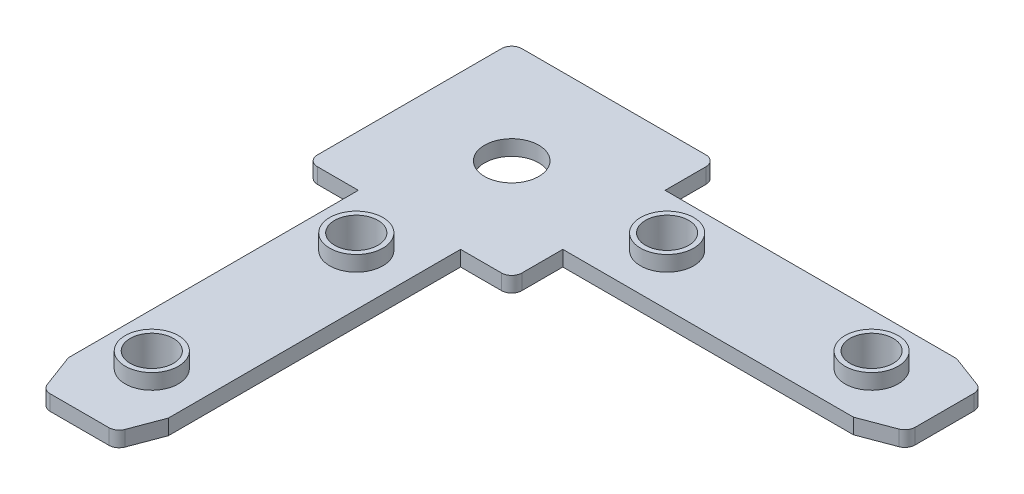
ISO-10303-21;
HEADER;
FILE_DESCRIPTION(('STEP AP214'),'2;1');
FILE_NAME('part.step','',(''),(''),'','','');
FILE_SCHEMA(('AUTOMOTIVE_DESIGN { 1 0 10303 214 1 1 1 1 }'));
ENDSEC;
DATA;
#1=APPLICATION_CONTEXT('core data for automotive mechanical design processes');
#2=APPLICATION_PROTOCOL_DEFINITION('international standard','automotive_design',2000,#1);
#3=PRODUCT_CONTEXT('',#1,'mechanical');
#4=PRODUCT('Part','Part','',(#3));
#5=PRODUCT_RELATED_PRODUCT_CATEGORY('part','',(#4));
#6=PRODUCT_DEFINITION_FORMATION('','',#4);
#7=PRODUCT_DEFINITION_CONTEXT('part definition',#1,'design');
#8=PRODUCT_DEFINITION('design','',#6,#7);
#9=PRODUCT_DEFINITION_SHAPE('','',#8);
#10=(LENGTH_UNIT() NAMED_UNIT(*) SI_UNIT(.MILLI.,.METRE.));
#11=(NAMED_UNIT(*) PLANE_ANGLE_UNIT() SI_UNIT($,.RADIAN.));
#12=(NAMED_UNIT(*) SI_UNIT($,.STERADIAN.) SOLID_ANGLE_UNIT());
#13=UNCERTAINTY_MEASURE_WITH_UNIT(LENGTH_MEASURE(1.E-05),#10,'distance_accuracy_value','');
#14=(GEOMETRIC_REPRESENTATION_CONTEXT(3) GLOBAL_UNCERTAINTY_ASSIGNED_CONTEXT((#13)) GLOBAL_UNIT_ASSIGNED_CONTEXT((#10,
#11,#12)) REPRESENTATION_CONTEXT('',''));
#15=CARTESIAN_POINT('',(0.,0.,0.));
#16=DIRECTION('',(0.,0.,1.));
#17=DIRECTION('',(1.,0.,0.));
#18=AXIS2_PLACEMENT_3D('',#15,#16,#17);
#19=CARTESIAN_POINT('',(0.,0.,0.));
#20=DIRECTION('',(-1.,0.,0.));
#21=DIRECTION('',(0.,0.,1.));
#22=AXIS2_PLACEMENT_3D('',#19,#20,#21);
#23=PLANE('',#22);
#24=DIRECTION('',(0.,0.,1.));
#25=VECTOR('',#24,1.);
#26=CARTESIAN_POINT('',(0.,0.05,5.));
#27=LINE('',#26,#25);
#28=CARTESIAN_POINT('',(0.,0.05,1.));
#29=VERTEX_POINT('',#28);
#30=CARTESIAN_POINT('',(0.,0.05,19.));
#31=VERTEX_POINT('',#30);
#32=EDGE_CURVE('E341',#29,#31,#27,.T.);
#33=ORIENTED_EDGE('',*,*,#32,.T.);
#34=DIRECTION('',(0.,-1.,0.));
#35=VECTOR('',#34,1.);
#36=CARTESIAN_POINT('',(0.,0.,19.));
#37=LINE('',#36,#35);
#38=CARTESIAN_POINT('',(0.,1.55,19.));
#39=VERTEX_POINT('',#38);
#40=EDGE_CURVE('E11',#39,#31,#37,.T.);
#41=ORIENTED_EDGE('',*,*,#40,.F.);
#42=DIRECTION('',(0.,0.,1.));
#43=VECTOR('',#42,1.);
#44=CARTESIAN_POINT('',(0.,1.55,20.));
#45=LINE('',#44,#43);
#46=CARTESIAN_POINT('',(0.,1.55,1.));
#47=VERTEX_POINT('',#46);
#48=EDGE_CURVE('E381',#47,#39,#45,.T.);
#49=ORIENTED_EDGE('',*,*,#48,.F.);
#50=DIRECTION('',(0.,1.,0.));
#51=VECTOR('',#50,1.);
#52=CARTESIAN_POINT('',(0.,0.,1.));
#53=LINE('',#52,#51);
#54=EDGE_CURVE('E540',#29,#47,#53,.T.);
#55=ORIENTED_EDGE('',*,*,#54,.F.);
#56=EDGE_LOOP('',(#33,#41,#49,#55));
#57=FACE_BOUND('',#56,.T.);
#58=ADVANCED_FACE('F16',(#57),#23,.T.);
#59=CARTESIAN_POINT('',(1.,0.,19.));
#60=DIRECTION('',(0.,1.,0.));
#61=DIRECTION('',(-0.707106781186547,0.,0.707106781186548));
#62=AXIS2_PLACEMENT_3D('',#59,#60,#61);
#63=CYLINDRICAL_SURFACE('',#62,1.);
#64=CARTESIAN_POINT('',(1.,0.05,19.));
#65=DIRECTION('',(0.,1.,0.));
#66=DIRECTION('',(-0.707106781186547,0.,0.707106781186548));
#67=AXIS2_PLACEMENT_3D('',#64,#65,#66);
#68=CIRCLE('',#67,1.);
#69=CARTESIAN_POINT('',(1.,0.05,20.));
#70=VERTEX_POINT('',#69);
#71=EDGE_CURVE('E337',#31,#70,#68,.T.);
#72=ORIENTED_EDGE('',*,*,#71,.T.);
#73=DIRECTION('',(0.,1.,0.));
#74=VECTOR('',#73,1.);
#75=CARTESIAN_POINT('',(1.,0.,20.));
#76=LINE('',#75,#74);
#77=CARTESIAN_POINT('',(1.,1.55,20.));
#78=VERTEX_POINT('',#77);
#79=EDGE_CURVE('E517',#70,#78,#76,.T.);
#80=ORIENTED_EDGE('',*,*,#79,.T.);
#81=CARTESIAN_POINT('',(1.,1.55,19.));
#82=DIRECTION('',(0.,-1.,0.));
#83=DIRECTION('',(-0.707106781186547,0.,0.707106781186548));
#84=AXIS2_PLACEMENT_3D('',#81,#82,#83);
#85=CIRCLE('',#84,1.);
#86=EDGE_CURVE('E27',#78,#39,#85,.T.);
#87=ORIENTED_EDGE('',*,*,#86,.T.);
#88=ORIENTED_EDGE('',*,*,#40,.T.);
#89=EDGE_LOOP('',(#72,#80,#87,#88));
#90=FACE_BOUND('',#89,.T.);
#91=ADVANCED_FACE('F752',(#90),#63,.T.);
#92=CARTESIAN_POINT('',(19.,0.,1.));
#93=DIRECTION('',(0.,1.,0.));
#94=DIRECTION('',(0.707106781186548,0.,-0.707106781186547));
#95=AXIS2_PLACEMENT_3D('',#92,#93,#94);
#96=CYLINDRICAL_SURFACE('',#95,1.);
#97=CARTESIAN_POINT('',(19.,0.05,1.));
#98=DIRECTION('',(0.,1.,0.));
#99=DIRECTION('',(0.707106781186548,0.,-0.707106781186547));
#100=AXIS2_PLACEMENT_3D('',#97,#98,#99);
#101=CIRCLE('',#100,1.);
#102=CARTESIAN_POINT('',(20.,0.05,1.));
#103=VERTEX_POINT('',#102);
#104=CARTESIAN_POINT('',(19.,0.05,0.));
#105=VERTEX_POINT('',#104);
#106=EDGE_CURVE('E436',#103,#105,#101,.T.);
#107=ORIENTED_EDGE('',*,*,#106,.T.);
#108=DIRECTION('',(0.,1.,0.));
#109=VECTOR('',#108,1.);
#110=CARTESIAN_POINT('',(19.,0.,0.));
#111=LINE('',#110,#109);
#112=CARTESIAN_POINT('',(19.,1.55,0.));
#113=VERTEX_POINT('',#112);
#114=EDGE_CURVE('E367',#105,#113,#111,.T.);
#115=ORIENTED_EDGE('',*,*,#114,.T.);
#116=CARTESIAN_POINT('',(19.,1.55,1.));
#117=DIRECTION('',(0.,-1.,0.));
#118=DIRECTION('',(0.707106781186548,0.,-0.707106781186547));
#119=AXIS2_PLACEMENT_3D('',#116,#117,#118);
#120=CIRCLE('',#119,1.);
#121=CARTESIAN_POINT('',(20.,1.55,1.));
#122=VERTEX_POINT('',#121);
#123=EDGE_CURVE('E371',#113,#122,#120,.T.);
#124=ORIENTED_EDGE('',*,*,#123,.T.);
#125=DIRECTION('',(0.,-1.,0.));
#126=VECTOR('',#125,1.);
#127=CARTESIAN_POINT('',(20.,0.,1.));
#128=LINE('',#127,#126);
#129=EDGE_CURVE('E449',#122,#103,#128,.T.);
#130=ORIENTED_EDGE('',*,*,#129,.T.);
#131=EDGE_LOOP('',(#107,#115,#124,#130));
#132=FACE_BOUND('',#131,.T.);
#133=ADVANCED_FACE('F747',(#132),#96,.T.);
#134=CARTESIAN_POINT('',(10.,1.55,10.));
#135=DIRECTION('',(0.,1.,0.));
#136=DIRECTION('',(1.,0.,0.));
#137=AXIS2_PLACEMENT_3D('',#134,#135,#136);
#138=PLANE('',#137);
#139=CARTESIAN_POINT('',(10.,1.55,10.));
#140=DIRECTION('',(0.,-1.,0.));
#141=DIRECTION('',(1.,0.,0.));
#142=AXIS2_PLACEMENT_3D('',#139,#140,#141);
#143=CIRCLE('',#142,2.65);
#144=CARTESIAN_POINT('',(7.35,1.55,10.));
#145=VERTEX_POINT('',#144);
#146=EDGE_CURVE('E537',#145,#145,#143,.T.);
#147=ORIENTED_EDGE('',*,*,#146,.T.);
#148=EDGE_LOOP('',(#147));
#149=FACE_BOUND('',#148,.T.);
#150=CARTESIAN_POINT('',(10.,1.55,25.2));
#151=DIRECTION('',(0.,-1.,0.));
#152=DIRECTION('',(-1.,0.,0.));
#153=AXIS2_PLACEMENT_3D('',#150,#151,#152);
#154=CIRCLE('',#153,2.6);
#155=CARTESIAN_POINT('',(12.6,1.55,25.2));
#156=VERTEX_POINT('',#155);
#157=EDGE_CURVE('E254',#156,#156,#154,.T.);
#158=ORIENTED_EDGE('',*,*,#157,.T.);
#159=EDGE_LOOP('',(#158));
#160=FACE_BOUND('',#159,.T.);
#161=CARTESIAN_POINT('',(25.2,1.55,10.));
#162=DIRECTION('',(0.,-1.,0.));
#163=DIRECTION('',(-1.,0.,0.));
#164=AXIS2_PLACEMENT_3D('',#161,#162,#163);
#165=CIRCLE('',#164,2.6);
#166=CARTESIAN_POINT('',(27.8,1.55,10.));
#167=VERTEX_POINT('',#166);
#168=EDGE_CURVE('E20',#167,#167,#165,.T.);
#169=ORIENTED_EDGE('',*,*,#168,.T.);
#170=EDGE_LOOP('',(#169));
#171=FACE_BOUND('',#170,.T.);
#172=CARTESIAN_POINT('',(10.,1.55,45.2));
#173=DIRECTION('',(0.,-1.,0.));
#174=DIRECTION('',(-1.,0.,0.));
#175=AXIS2_PLACEMENT_3D('',#172,#173,#174);
#176=CIRCLE('',#175,2.6);
#177=CARTESIAN_POINT('',(12.6,1.55,45.2));
#178=VERTEX_POINT('',#177);
#179=EDGE_CURVE('E365',#178,#178,#176,.T.);
#180=ORIENTED_EDGE('',*,*,#179,.T.);
#181=EDGE_LOOP('',(#180));
#182=FACE_BOUND('',#181,.T.);
#183=CARTESIAN_POINT('',(45.2,1.55,10.));
#184=DIRECTION('',(0.,-1.,0.));
#185=DIRECTION('',(-1.,0.,0.));
#186=AXIS2_PLACEMENT_3D('',#183,#184,#185);
#187=CIRCLE('',#186,2.6);
#188=CARTESIAN_POINT('',(47.8,1.55,10.));
#189=VERTEX_POINT('',#188);
#190=EDGE_CURVE('E366',#189,#189,#187,.T.);
#191=ORIENTED_EDGE('',*,*,#190,.T.);
#192=EDGE_LOOP('',(#191));
#193=FACE_BOUND('',#192,.T.);
#194=CARTESIAN_POINT('',(51.3,1.55,7.10603201825691));
#195=DIRECTION('',(0.,-1.,0.));
#196=DIRECTION('',(0.821616308212907,0.,-0.570040912635746));
#197=AXIS2_PLACEMENT_3D('',#194,#195,#196);
#198=CIRCLE('',#197,1.);
#199=CARTESIAN_POINT('',(51.6501067158428,1.55,6.16932219791671));
#200=VERTEX_POINT('',#199);
#201=CARTESIAN_POINT('',(52.3,1.55,7.10603201825691));
#202=VERTEX_POINT('',#201);
#203=EDGE_CURVE('E330',#200,#202,#198,.T.);
#204=ORIENTED_EDGE('',*,*,#203,.F.);
#205=DIRECTION('',(-0.936709820340194,0.,-0.350106715842815));
#206=VECTOR('',#205,1.);
#207=CARTESIAN_POINT('',(48.5215875062253,1.55,5.));
#208=LINE('',#207,#206);
#209=CARTESIAN_POINT('',(48.5215875062253,1.55,5.));
#210=VERTEX_POINT('',#209);
#211=EDGE_CURVE('E411',#200,#210,#208,.T.);
#212=ORIENTED_EDGE('',*,*,#211,.T.);
#213=DIRECTION('',(-1.,0.,0.));
#214=VECTOR('',#213,1.);
#215=CARTESIAN_POINT('',(48.5215875062253,1.55,5.));
#216=LINE('',#215,#214);
#217=CARTESIAN_POINT('',(20.,1.55,5.));
#218=VERTEX_POINT('',#217);
#219=EDGE_CURVE('E412',#210,#218,#216,.T.);
#220=ORIENTED_EDGE('',*,*,#219,.T.);
#221=DIRECTION('',(0.,0.,-1.));
#222=VECTOR('',#221,1.);
#223=CARTESIAN_POINT('',(20.,1.55,0.));
#224=LINE('',#223,#222);
#225=EDGE_CURVE('E243',#218,#122,#224,.T.);
#226=ORIENTED_EDGE('',*,*,#225,.T.);
#227=ORIENTED_EDGE('',*,*,#123,.F.);
#228=DIRECTION('',(-1.,0.,0.));
#229=VECTOR('',#228,1.);
#230=CARTESIAN_POINT('',(0.,1.55,0.));
#231=LINE('',#230,#229);
#232=CARTESIAN_POINT('',(1.,1.55,0.));
#233=VERTEX_POINT('',#232);
#234=EDGE_CURVE('E372',#113,#233,#231,.T.);
#235=ORIENTED_EDGE('',*,*,#234,.T.);
#236=CARTESIAN_POINT('',(1.,1.55,1.));
#237=DIRECTION('',(0.,-1.,0.));
#238=DIRECTION('',(-0.707106781186547,0.,-0.707106781186548));
#239=AXIS2_PLACEMENT_3D('',#236,#237,#238);
#240=CIRCLE('',#239,1.);
#241=EDGE_CURVE('E526',#47,#233,#240,.T.);
#242=ORIENTED_EDGE('',*,*,#241,.F.);
#243=ORIENTED_EDGE('',*,*,#48,.T.);
#244=ORIENTED_EDGE('',*,*,#86,.F.);
#245=DIRECTION('',(1.,0.,0.));
#246=VECTOR('',#245,1.);
#247=CARTESIAN_POINT('',(20.,1.55,20.));
#248=LINE('',#247,#246);
#249=CARTESIAN_POINT('',(5.,1.55,20.));
#250=VERTEX_POINT('',#249);
#251=EDGE_CURVE('E522',#78,#250,#248,.T.);
#252=ORIENTED_EDGE('',*,*,#251,.T.);
#253=DIRECTION('',(0.,0.,1.));
#254=VECTOR('',#253,1.);
#255=CARTESIAN_POINT('',(5.,1.55,48.362618433622));
#256=LINE('',#255,#254);
#257=CARTESIAN_POINT('',(5.,1.55,48.362618433622));
#258=VERTEX_POINT('',#257);
#259=EDGE_CURVE('E510',#250,#258,#256,.T.);
#260=ORIENTED_EDGE('',*,*,#259,.T.);
#261=DIRECTION('',(0.350106715842814,0.,0.936709820340194));
#262=VECTOR('',#261,1.);
#263=CARTESIAN_POINT('',(6.4716443655133,1.55,52.3));
#264=LINE('',#263,#262);
#265=CARTESIAN_POINT('',(6.22873882697423,1.55,51.6501067158428));
#266=VERTEX_POINT('',#265);
#267=EDGE_CURVE('E500',#258,#266,#264,.T.);
#268=ORIENTED_EDGE('',*,*,#267,.T.);
#269=CARTESIAN_POINT('',(7.16544864731442,1.55,51.3));
#270=DIRECTION('',(0.,-1.,0.));
#271=DIRECTION('',(-0.570040912635746,0.,0.821616308212907));
#272=AXIS2_PLACEMENT_3D('',#269,#270,#271);
#273=CIRCLE('',#272,1.);
#274=CARTESIAN_POINT('',(7.16544864731442,1.55,52.3));
#275=VERTEX_POINT('',#274);
#276=EDGE_CURVE('E326',#275,#266,#273,.T.);
#277=ORIENTED_EDGE('',*,*,#276,.F.);
#278=DIRECTION('',(1.,0.,0.));
#279=VECTOR('',#278,1.);
#280=CARTESIAN_POINT('',(13.599486309307,1.55,52.3));
#281=LINE('',#280,#279);
#282=CARTESIAN_POINT('',(12.9073882325654,1.55,52.3));
#283=VERTEX_POINT('',#282);
#284=EDGE_CURVE('E393',#275,#283,#281,.T.);
#285=ORIENTED_EDGE('',*,*,#284,.T.);
#286=CARTESIAN_POINT('',(12.9073882325654,1.55,51.3));
#287=DIRECTION('',(0.,-1.,0.));
#288=DIRECTION('',(0.569093456951135,0.,0.822272848424054));
#289=AXIS2_PLACEMENT_3D('',#286,#287,#288);
#290=CIRCLE('',#289,1.);
#291=CARTESIAN_POINT('',(13.8432884282988,1.55,51.6522652745108));
#292=VERTEX_POINT('',#291);
#293=EDGE_CURVE('E427',#292,#283,#290,.T.);
#294=ORIENTED_EDGE('',*,*,#293,.F.);
#295=DIRECTION('',(0.352265274510817,0.,-0.935900195733401));
#296=VECTOR('',#295,1.);
#297=CARTESIAN_POINT('',(13.599486309307,1.55,52.3));
#298=LINE('',#297,#296);
#299=CARTESIAN_POINT('',(15.,1.55,48.5791080129398));
#300=VERTEX_POINT('',#299);
#301=EDGE_CURVE('E426',#292,#300,#298,.T.);
#302=ORIENTED_EDGE('',*,*,#301,.T.);
#303=DIRECTION('',(0.,0.,-1.));
#304=VECTOR('',#303,1.);
#305=CARTESIAN_POINT('',(15.,1.55,20.));
#306=LINE('',#305,#304);
#307=CARTESIAN_POINT('',(15.,1.55,20.));
#308=VERTEX_POINT('',#307);
#309=EDGE_CURVE('E347',#300,#308,#306,.T.);
#310=ORIENTED_EDGE('',*,*,#309,.T.);
#311=DIRECTION('',(1.,0.,0.));
#312=VECTOR('',#311,1.);
#313=CARTESIAN_POINT('',(20.,1.55,20.));
#314=LINE('',#313,#312);
#315=CARTESIAN_POINT('',(19.,1.55,20.));
#316=VERTEX_POINT('',#315);
#317=EDGE_CURVE('E360',#308,#316,#314,.T.);
#318=ORIENTED_EDGE('',*,*,#317,.T.);
#319=CARTESIAN_POINT('',(19.,1.55,19.));
#320=DIRECTION('',(0.,-1.,0.));
#321=DIRECTION('',(0.707106781186548,0.,0.707106781186548));
#322=AXIS2_PLACEMENT_3D('',#319,#320,#321);
#323=CIRCLE('',#322,1.);
#324=CARTESIAN_POINT('',(20.,1.55,19.));
#325=VERTEX_POINT('',#324);
#326=EDGE_CURVE('E296',#325,#316,#323,.T.);
#327=ORIENTED_EDGE('',*,*,#326,.F.);
#328=DIRECTION('',(0.,0.,-1.));
#329=VECTOR('',#328,1.);
#330=CARTESIAN_POINT('',(20.,1.55,0.));
#331=LINE('',#330,#329);
#332=CARTESIAN_POINT('',(20.,1.55,15.));
#333=VERTEX_POINT('',#332);
#334=EDGE_CURVE('E295',#325,#333,#331,.T.);
#335=ORIENTED_EDGE('',*,*,#334,.T.);
#336=DIRECTION('',(1.,0.,0.));
#337=VECTOR('',#336,1.);
#338=CARTESIAN_POINT('',(20.,1.55,15.));
#339=LINE('',#338,#337);
#340=CARTESIAN_POINT('',(48.4216847114083,1.55,15.));
#341=VERTEX_POINT('',#340);
#342=EDGE_CURVE('E291',#333,#341,#339,.T.);
#343=ORIENTED_EDGE('',*,*,#342,.T.);
#344=DIRECTION('',(0.935900195733402,0.,-0.352265274510816));
#345=VECTOR('',#344,1.);
#346=CARTESIAN_POINT('',(48.4216847114083,1.55,15.));
#347=LINE('',#346,#345);
#348=CARTESIAN_POINT('',(51.6522652745108,1.55,13.7840355690931));
#349=VERTEX_POINT('',#348);
#350=EDGE_CURVE('E465',#341,#349,#347,.T.);
#351=ORIENTED_EDGE('',*,*,#350,.T.);
#352=CARTESIAN_POINT('',(51.3,1.55,12.8481353733597));
#353=DIRECTION('',(0.,-1.,0.));
#354=DIRECTION('',(0.822272848424054,0.,0.569093456951135));
#355=AXIS2_PLACEMENT_3D('',#352,#353,#354);
#356=CIRCLE('',#355,1.);
#357=CARTESIAN_POINT('',(52.3,1.55,12.8481353733597));
#358=VERTEX_POINT('',#357);
#359=EDGE_CURVE('E432',#358,#349,#356,.T.);
#360=ORIENTED_EDGE('',*,*,#359,.F.);
#361=DIRECTION('',(0.,0.,-1.));
#362=VECTOR('',#361,1.);
#363=CARTESIAN_POINT('',(52.3,1.55,13.5402334501013));
#364=LINE('',#363,#362);
#365=EDGE_CURVE('E431',#358,#202,#364,.T.);
#366=ORIENTED_EDGE('',*,*,#365,.T.);
#367=EDGE_LOOP('',(#204,#212,#220,#226,#227,#235,#242,#243,#244,#252,#260,#268,#277,#285,#294,
#302,#310,#318,#327,#335,#343,#351,#360,#366));
#368=FACE_BOUND('',#367,.T.);
#369=ADVANCED_FACE('F665',(#149,#160,#171,#182,#193,#368),#138,.T.);
#370=CARTESIAN_POINT('',(20.,0.,0.));
#371=DIRECTION('',(0.,0.,-1.));
#372=DIRECTION('',(-1.,0.,0.));
#373=AXIS2_PLACEMENT_3D('',#370,#371,#372);
#374=PLANE('',#373);
#375=DIRECTION('',(-1.,0.,0.));
#376=VECTOR('',#375,1.);
#377=CARTESIAN_POINT('',(15.,0.05,0.));
#378=LINE('',#377,#376);
#379=CARTESIAN_POINT('',(1.,0.05,0.));
#380=VERTEX_POINT('',#379);
#381=EDGE_CURVE('E357',#105,#380,#378,.T.);
#382=ORIENTED_EDGE('',*,*,#381,.T.);
#383=DIRECTION('',(0.,-1.,0.));
#384=VECTOR('',#383,1.);
#385=CARTESIAN_POINT('',(1.,0.,0.));
#386=LINE('',#385,#384);
#387=EDGE_CURVE('E523',#233,#380,#386,.T.);
#388=ORIENTED_EDGE('',*,*,#387,.F.);
#389=ORIENTED_EDGE('',*,*,#234,.F.);
#390=ORIENTED_EDGE('',*,*,#114,.F.);
#391=EDGE_LOOP('',(#382,#388,#389,#390));
#392=FACE_BOUND('',#391,.T.);
#393=ADVANCED_FACE('F659',(#392),#374,.T.);
#394=CARTESIAN_POINT('',(1.,0.,1.));
#395=DIRECTION('',(0.,1.,0.));
#396=DIRECTION('',(-0.707106781186547,0.,-0.707106781186548));
#397=AXIS2_PLACEMENT_3D('',#394,#395,#396);
#398=CYLINDRICAL_SURFACE('',#397,1.);
#399=CARTESIAN_POINT('',(1.,0.05,1.));
#400=DIRECTION('',(0.,1.,0.));
#401=DIRECTION('',(-0.707106781186547,0.,-0.707106781186548));
#402=AXIS2_PLACEMENT_3D('',#399,#400,#401);
#403=CIRCLE('',#402,1.);
#404=EDGE_CURVE('E353',#380,#29,#403,.T.);
#405=ORIENTED_EDGE('',*,*,#404,.T.);
#406=ORIENTED_EDGE('',*,*,#54,.T.);
#407=ORIENTED_EDGE('',*,*,#241,.T.);
#408=ORIENTED_EDGE('',*,*,#387,.T.);
#409=EDGE_LOOP('',(#405,#406,#407,#408));
#410=FACE_BOUND('',#409,.T.);
#411=ADVANCED_FACE('F664',(#410),#398,.T.);
#412=CARTESIAN_POINT('',(10.,0.,10.));
#413=DIRECTION('',(0.,1.,0.));
#414=DIRECTION('',(1.,0.,0.));
#415=AXIS2_PLACEMENT_3D('',#412,#413,#414);
#416=CYLINDRICAL_SURFACE('',#415,2.65);
#417=CARTESIAN_POINT('',(10.,0.05,10.));
#418=DIRECTION('',(0.,-1.,0.));
#419=DIRECTION('',(1.,0.,0.));
#420=AXIS2_PLACEMENT_3D('',#417,#418,#419);
#421=CIRCLE('',#420,2.65);
#422=CARTESIAN_POINT('',(7.35,0.05,10.));
#423=VERTEX_POINT('',#422);
#424=EDGE_CURVE('E335',#423,#423,#421,.T.);
#425=ORIENTED_EDGE('',*,*,#424,.T.);
#426=DIRECTION('',(0.,1.,0.));
#427=VECTOR('',#426,1.);
#428=CARTESIAN_POINT('',(7.35,0.,10.));
#429=LINE('',#428,#427);
#430=EDGE_CURVE('E521',#423,#145,#429,.T.);
#431=ORIENTED_EDGE('',*,*,#430,.T.);
#432=ORIENTED_EDGE('',*,*,#146,.F.);
#433=ORIENTED_EDGE('',*,*,#430,.F.);
#434=EDGE_LOOP('',(#425,#431,#432,#433));
#435=FACE_BOUND('',#434,.T.);
#436=ADVANCED_FACE('F686',(#435),#416,.F.);
#437=CARTESIAN_POINT('',(0.,0.,20.));
#438=DIRECTION('',(0.,0.,1.));
#439=DIRECTION('',(1.,0.,0.));
#440=AXIS2_PLACEMENT_3D('',#437,#438,#439);
#441=PLANE('',#440);
#442=DIRECTION('',(1.,0.,0.));
#443=VECTOR('',#442,1.);
#444=CARTESIAN_POINT('',(5.,0.05,20.));
#445=LINE('',#444,#443);
#446=CARTESIAN_POINT('',(5.,0.05,20.));
#447=VERTEX_POINT('',#446);
#448=EDGE_CURVE('E342',#70,#447,#445,.T.);
#449=ORIENTED_EDGE('',*,*,#448,.T.);
#450=DIRECTION('',(0.,1.,0.));
#451=VECTOR('',#450,1.);
#452=CARTESIAN_POINT('',(5.,0.,20.));
#453=LINE('',#452,#451);
#454=EDGE_CURVE('E513',#447,#250,#453,.T.);
#455=ORIENTED_EDGE('',*,*,#454,.T.);
#456=ORIENTED_EDGE('',*,*,#251,.F.);
#457=ORIENTED_EDGE('',*,*,#79,.F.);
#458=EDGE_LOOP('',(#449,#455,#456,#457));
#459=FACE_BOUND('',#458,.T.);
#460=ADVANCED_FACE('F691',(#459),#441,.T.);
#461=CARTESIAN_POINT('',(5.,0.,20.));
#462=DIRECTION('',(-1.,0.,0.));
#463=DIRECTION('',(0.,0.,1.));
#464=AXIS2_PLACEMENT_3D('',#461,#462,#463);
#465=PLANE('',#464);
#466=DIRECTION('',(0.,0.,1.));
#467=VECTOR('',#466,1.);
#468=CARTESIAN_POINT('',(5.,0.05,15.));
#469=LINE('',#468,#467);
#470=CARTESIAN_POINT('',(5.,0.05,48.362618433622));
#471=VERTEX_POINT('',#470);
#472=EDGE_CURVE('E377',#447,#471,#469,.T.);
#473=ORIENTED_EDGE('',*,*,#472,.T.);
#474=DIRECTION('',(0.,1.,0.));
#475=VECTOR('',#474,1.);
#476=CARTESIAN_POINT('',(5.,0.,48.362618433622));
#477=LINE('',#476,#475);
#478=EDGE_CURVE('E509',#471,#258,#477,.T.);
#479=ORIENTED_EDGE('',*,*,#478,.T.);
#480=ORIENTED_EDGE('',*,*,#259,.F.);
#481=ORIENTED_EDGE('',*,*,#454,.F.);
#482=EDGE_LOOP('',(#473,#479,#480,#481));
#483=FACE_BOUND('',#482,.T.);
#484=ADVANCED_FACE('F794',(#483),#465,.T.);
#485=CARTESIAN_POINT('',(5.,0.,48.362618433622));
#486=DIRECTION('',(-0.936709820340194,0.,0.350106715842814));
#487=DIRECTION('',(0.,1.,0.));
#488=AXIS2_PLACEMENT_3D('',#485,#486,#487);
#489=PLANE('',#488);
#490=DIRECTION('',(0.350106715842814,0.,0.936709820340194));
#491=VECTOR('',#490,1.);
#492=CARTESIAN_POINT('',(-0.984042865206179,0.05,32.3523236762604));
#493=LINE('',#492,#491);
#494=CARTESIAN_POINT('',(6.22873882697423,0.05,51.6501067158428));
#495=VERTEX_POINT('',#494);
#496=EDGE_CURVE('E373',#471,#495,#493,.T.);
#497=ORIENTED_EDGE('',*,*,#496,.T.);
#498=DIRECTION('',(0.,-1.,0.));
#499=VECTOR('',#498,1.);
#500=CARTESIAN_POINT('',(6.22873882697423,0.,51.6501067158428));
#501=LINE('',#500,#499);
#502=EDGE_CURVE('E329',#266,#495,#501,.T.);
#503=ORIENTED_EDGE('',*,*,#502,.F.);
#504=ORIENTED_EDGE('',*,*,#267,.F.);
#505=ORIENTED_EDGE('',*,*,#478,.F.);
#506=EDGE_LOOP('',(#497,#503,#504,#505));
#507=FACE_BOUND('',#506,.T.);
#508=ADVANCED_FACE('F799',(#507),#489,.T.);
#509=CARTESIAN_POINT('',(20.,0.,20.));
#510=DIRECTION('',(1.,0.,0.));
#511=DIRECTION('',(0.,1.,0.));
#512=AXIS2_PLACEMENT_3D('',#509,#510,#511);
#513=PLANE('',#512);
#514=DIRECTION('',(0.,0.,-1.));
#515=VECTOR('',#514,1.);
#516=CARTESIAN_POINT('',(20.,0.05,15.));
#517=LINE('',#516,#515);
#518=CARTESIAN_POINT('',(20.,0.05,5.));
#519=VERTEX_POINT('',#518);
#520=EDGE_CURVE('E489',#519,#103,#517,.T.);
#521=ORIENTED_EDGE('',*,*,#520,.T.);
#522=ORIENTED_EDGE('',*,*,#129,.F.);
#523=ORIENTED_EDGE('',*,*,#225,.F.);
#524=DIRECTION('',(0.,-1.,0.));
#525=VECTOR('',#524,1.);
#526=CARTESIAN_POINT('',(20.,0.,5.));
#527=LINE('',#526,#525);
#528=EDGE_CURVE('E402',#218,#519,#527,.T.);
#529=ORIENTED_EDGE('',*,*,#528,.T.);
#530=EDGE_LOOP('',(#521,#522,#523,#529));
#531=FACE_BOUND('',#530,.T.);
#532=ADVANCED_FACE('F809',(#531),#513,.T.);
#533=CARTESIAN_POINT('',(52.3,0.,6.41222773645579));
#534=DIRECTION('',(0.350106715842815,0.,-0.936709820340194));
#535=DIRECTION('',(0.,-1.,0.));
#536=AXIS2_PLACEMENT_3D('',#533,#534,#535);
#537=PLANE('',#536);
#538=DIRECTION('',(-0.936709820340194,0.,-0.350106715842815));
#539=VECTOR('',#538,1.);
#540=CARTESIAN_POINT('',(34.330757253633,0.05,-0.303995823395481));
#541=LINE('',#540,#539);
#542=CARTESIAN_POINT('',(51.6501067158428,0.05,6.16932219791671));
#543=VERTEX_POINT('',#542);
#544=CARTESIAN_POINT('',(48.5215875062253,0.05,5.));
#545=VERTEX_POINT('',#544);
#546=EDGE_CURVE('E456',#543,#545,#541,.T.);
#547=ORIENTED_EDGE('',*,*,#546,.T.);
#548=DIRECTION('',(0.,1.,0.));
#549=VECTOR('',#548,1.);
#550=CARTESIAN_POINT('',(48.5215875062253,0.,5.));
#551=LINE('',#550,#549);
#552=EDGE_CURVE('E407',#545,#210,#551,.T.);
#553=ORIENTED_EDGE('',*,*,#552,.T.);
#554=ORIENTED_EDGE('',*,*,#211,.F.);
#555=DIRECTION('',(0.,1.,0.));
#556=VECTOR('',#555,1.);
#557=CARTESIAN_POINT('',(51.6501067158428,0.,6.16932219791671));
#558=LINE('',#557,#556);
#559=EDGE_CURVE('E516',#543,#200,#558,.T.);
#560=ORIENTED_EDGE('',*,*,#559,.F.);
#561=EDGE_LOOP('',(#547,#553,#554,#560));
#562=FACE_BOUND('',#561,.T.);
#563=ADVANCED_FACE('F909',(#562),#537,.T.);
#564=CARTESIAN_POINT('',(48.5215875062253,0.,5.));
#565=DIRECTION('',(0.,0.,-1.));
#566=DIRECTION('',(0.,-1.,0.));
#567=AXIS2_PLACEMENT_3D('',#564,#565,#566);
#568=PLANE('',#567);
#569=DIRECTION('',(-1.,0.,0.));
#570=VECTOR('',#569,1.);
#571=CARTESIAN_POINT('',(29.2607937531126,0.05,5.));
#572=LINE('',#571,#570);
#573=EDGE_CURVE('E461',#545,#519,#572,.T.);
#574=ORIENTED_EDGE('',*,*,#573,.T.);
#575=ORIENTED_EDGE('',*,*,#528,.F.);
#576=ORIENTED_EDGE('',*,*,#219,.F.);
#577=ORIENTED_EDGE('',*,*,#552,.F.);
#578=EDGE_LOOP('',(#574,#575,#576,#577));
#579=FACE_BOUND('',#578,.T.);
#580=ADVANCED_FACE('F904',(#579),#568,.T.);
#581=CARTESIAN_POINT('',(45.2,0.,10.));
#582=DIRECTION('',(0.,1.,0.));
#583=DIRECTION('',(1.,0.,0.));
#584=AXIS2_PLACEMENT_3D('',#581,#582,#583);
#585=CYLINDRICAL_SURFACE('',#584,2.117);
#586=CARTESIAN_POINT('',(45.2,0.05,10.));
#587=DIRECTION('',(0.,-1.,0.));
#588=DIRECTION('',(1.,0.,0.));
#589=AXIS2_PLACEMENT_3D('',#586,#587,#588);
#590=CIRCLE('',#589,2.117);
#591=CARTESIAN_POINT('',(43.083,0.05,10.));
#592=VERTEX_POINT('',#591);
#593=EDGE_CURVE('E331',#592,#592,#590,.T.);
#594=ORIENTED_EDGE('',*,*,#593,.T.);
#595=DIRECTION('',(0.,1.,0.));
#596=VECTOR('',#595,1.);
#597=CARTESIAN_POINT('',(43.083,0.,10.));
#598=LINE('',#597,#596);
#599=CARTESIAN_POINT('',(43.083,3.05,10.));
#600=VERTEX_POINT('',#599);
#601=EDGE_CURVE('E399',#592,#600,#598,.T.);
#602=ORIENTED_EDGE('',*,*,#601,.T.);
#603=CARTESIAN_POINT('',(45.2,3.05,10.));
#604=DIRECTION('',(0.,1.,0.));
#605=DIRECTION('',(1.,0.,0.));
#606=AXIS2_PLACEMENT_3D('',#603,#604,#605);
#607=CIRCLE('',#606,2.117);
#608=EDGE_CURVE('E324',#600,#600,#607,.T.);
#609=ORIENTED_EDGE('',*,*,#608,.T.);
#610=ORIENTED_EDGE('',*,*,#601,.F.);
#611=EDGE_LOOP('',(#594,#602,#609,#610));
#612=FACE_BOUND('',#611,.T.);
#613=ADVANCED_FACE('F875',(#612),#585,.F.);
#614=CARTESIAN_POINT('',(10.,0.,45.2));
#615=DIRECTION('',(0.,1.,0.));
#616=DIRECTION('',(1.,0.,0.));
#617=AXIS2_PLACEMENT_3D('',#614,#615,#616);
#618=CYLINDRICAL_SURFACE('',#617,2.117);
#619=CARTESIAN_POINT('',(10.,0.05,45.2));
#620=DIRECTION('',(0.,-1.,0.));
#621=DIRECTION('',(1.,0.,0.));
#622=AXIS2_PLACEMENT_3D('',#619,#620,#621);
#623=CIRCLE('',#622,2.117);
#624=CARTESIAN_POINT('',(7.883,0.05,45.2));
#625=VERTEX_POINT('',#624);
#626=EDGE_CURVE('E336',#625,#625,#623,.T.);
#627=ORIENTED_EDGE('',*,*,#626,.T.);
#628=DIRECTION('',(0.,1.,0.));
#629=VECTOR('',#628,1.);
#630=CARTESIAN_POINT('',(7.883,0.,45.2));
#631=LINE('',#630,#629);
#632=CARTESIAN_POINT('',(7.883,3.05,45.2));
#633=VERTEX_POINT('',#632);
#634=EDGE_CURVE('E403',#625,#633,#631,.T.);
#635=ORIENTED_EDGE('',*,*,#634,.T.);
#636=CARTESIAN_POINT('',(10.,3.05,45.2));
#637=DIRECTION('',(0.,1.,0.));
#638=DIRECTION('',(1.,0.,0.));
#639=AXIS2_PLACEMENT_3D('',#636,#637,#638);
#640=CIRCLE('',#639,2.117);
#641=EDGE_CURVE('E420',#633,#633,#640,.T.);
#642=ORIENTED_EDGE('',*,*,#641,.T.);
#643=ORIENTED_EDGE('',*,*,#634,.F.);
#644=EDGE_LOOP('',(#627,#635,#642,#643));
#645=FACE_BOUND('',#644,.T.);
#646=ADVANCED_FACE('F679',(#645),#618,.F.);
#647=CARTESIAN_POINT('',(25.2,0.,10.));
#648=DIRECTION('',(0.,1.,0.));
#649=DIRECTION('',(1.,0.,0.));
#650=AXIS2_PLACEMENT_3D('',#647,#648,#649);
#651=CYLINDRICAL_SURFACE('',#650,2.117);
#652=CARTESIAN_POINT('',(25.2,0.05,10.));
#653=DIRECTION('',(0.,-1.,0.));
#654=DIRECTION('',(1.,0.,0.));
#655=AXIS2_PLACEMENT_3D('',#652,#653,#654);
#656=CIRCLE('',#655,2.117);
#657=CARTESIAN_POINT('',(23.083,0.05,10.));
#658=VERTEX_POINT('',#657);
#659=EDGE_CURVE('E346',#658,#658,#656,.T.);
#660=ORIENTED_EDGE('',*,*,#659,.T.);
#661=DIRECTION('',(0.,1.,0.));
#662=VECTOR('',#661,1.);
#663=CARTESIAN_POINT('',(23.083,0.,10.));
#664=LINE('',#663,#662);
#665=CARTESIAN_POINT('',(23.083,3.05,10.));
#666=VERTEX_POINT('',#665);
#667=EDGE_CURVE('E445',#658,#666,#664,.T.);
#668=ORIENTED_EDGE('',*,*,#667,.T.);
#669=CARTESIAN_POINT('',(25.2,3.05,10.));
#670=DIRECTION('',(0.,1.,0.));
#671=DIRECTION('',(1.,0.,0.));
#672=AXIS2_PLACEMENT_3D('',#669,#670,#671);
#673=CIRCLE('',#672,2.117);
#674=EDGE_CURVE('E421',#666,#666,#673,.T.);
#675=ORIENTED_EDGE('',*,*,#674,.T.);
#676=ORIENTED_EDGE('',*,*,#667,.F.);
#677=EDGE_LOOP('',(#660,#668,#675,#676));
#678=FACE_BOUND('',#677,.T.);
#679=ADVANCED_FACE('F640',(#678),#651,.F.);
#680=CARTESIAN_POINT('',(10.,0.,25.2));
#681=DIRECTION('',(0.,1.,0.));
#682=DIRECTION('',(1.,0.,0.));
#683=AXIS2_PLACEMENT_3D('',#680,#681,#682);
#684=CYLINDRICAL_SURFACE('',#683,2.117);
#685=CARTESIAN_POINT('',(10.,0.05,25.2));
#686=DIRECTION('',(0.,-1.,0.));
#687=DIRECTION('',(1.,0.,0.));
#688=AXIS2_PLACEMENT_3D('',#685,#686,#687);
#689=CIRCLE('',#688,2.117);
#690=CARTESIAN_POINT('',(7.883,0.05,25.2));
#691=VERTEX_POINT('',#690);
#692=EDGE_CURVE('E460',#691,#691,#689,.T.);
#693=ORIENTED_EDGE('',*,*,#692,.T.);
#694=DIRECTION('',(0.,1.,0.));
#695=VECTOR('',#694,1.);
#696=CARTESIAN_POINT('',(7.883,0.,25.2));
#697=LINE('',#696,#695);
#698=CARTESIAN_POINT('',(7.883,3.05,25.2));
#699=VERTEX_POINT('',#698);
#700=EDGE_CURVE('E448',#691,#699,#697,.T.);
#701=ORIENTED_EDGE('',*,*,#700,.T.);
#702=CARTESIAN_POINT('',(10.,3.05,25.2));
#703=DIRECTION('',(0.,1.,0.));
#704=DIRECTION('',(1.,0.,0.));
#705=AXIS2_PLACEMENT_3D('',#702,#703,#704);
#706=CIRCLE('',#705,2.117);
#707=EDGE_CURVE('E439',#699,#699,#706,.T.);
#708=ORIENTED_EDGE('',*,*,#707,.T.);
#709=ORIENTED_EDGE('',*,*,#700,.F.);
#710=EDGE_LOOP('',(#693,#701,#708,#709));
#711=FACE_BOUND('',#710,.T.);
#712=ADVANCED_FACE('F678',(#711),#684,.F.);
#713=CARTESIAN_POINT('',(10.,1.55,25.2));
#714=DIRECTION('',(0.,1.,0.));
#715=DIRECTION('',(-1.,0.,0.));
#716=AXIS2_PLACEMENT_3D('',#713,#714,#715);
#717=CYLINDRICAL_SURFACE('',#716,2.6);
#718=CARTESIAN_POINT('',(10.,3.05,25.2));
#719=DIRECTION('',(0.,-1.,0.));
#720=DIRECTION('',(-1.,0.,0.));
#721=AXIS2_PLACEMENT_3D('',#718,#719,#720);
#722=CIRCLE('',#721,2.6);
#723=CARTESIAN_POINT('',(12.6,3.05,25.2));
#724=VERTEX_POINT('',#723);
#725=EDGE_CURVE('E444',#724,#724,#722,.T.);
#726=ORIENTED_EDGE('',*,*,#725,.T.);
#727=DIRECTION('',(0.,-1.,0.));
#728=VECTOR('',#727,1.);
#729=CARTESIAN_POINT('',(12.6,1.55,25.2));
#730=LINE('',#729,#728);
#731=EDGE_CURVE('E503',#724,#156,#730,.T.);
#732=ORIENTED_EDGE('',*,*,#731,.T.);
#733=ORIENTED_EDGE('',*,*,#157,.F.);
#734=ORIENTED_EDGE('',*,*,#731,.F.);
#735=EDGE_LOOP('',(#726,#732,#733,#734));
#736=FACE_BOUND('',#735,.T.);
#737=ADVANCED_FACE('F882',(#736),#717,.T.);
#738=CARTESIAN_POINT('',(25.2,1.55,10.));
#739=DIRECTION('',(0.,1.,0.));
#740=DIRECTION('',(-1.,0.,0.));
#741=AXIS2_PLACEMENT_3D('',#738,#739,#740);
#742=CYLINDRICAL_SURFACE('',#741,2.6);
#743=CARTESIAN_POINT('',(25.2,3.05,10.));
#744=DIRECTION('',(0.,-1.,0.));
#745=DIRECTION('',(-1.,0.,0.));
#746=AXIS2_PLACEMENT_3D('',#743,#744,#745);
#747=CIRCLE('',#746,2.6);
#748=CARTESIAN_POINT('',(27.8,3.05,10.));
#749=VERTEX_POINT('',#748);
#750=EDGE_CURVE('E452',#749,#749,#747,.T.);
#751=ORIENTED_EDGE('',*,*,#750,.T.);
#752=DIRECTION('',(0.,-1.,0.));
#753=VECTOR('',#752,1.);
#754=CARTESIAN_POINT('',(27.8,1.55,10.));
#755=LINE('',#754,#753);
#756=EDGE_CURVE('E527',#749,#167,#755,.T.);
#757=ORIENTED_EDGE('',*,*,#756,.T.);
#758=ORIENTED_EDGE('',*,*,#168,.F.);
#759=ORIENTED_EDGE('',*,*,#756,.F.);
#760=EDGE_LOOP('',(#751,#757,#758,#759));
#761=FACE_BOUND('',#760,.T.);
#762=ADVANCED_FACE('F652',(#761),#742,.T.);
#763=CARTESIAN_POINT('',(10.,1.55,45.2));
#764=DIRECTION('',(0.,1.,0.));
#765=DIRECTION('',(-1.,0.,0.));
#766=AXIS2_PLACEMENT_3D('',#763,#764,#765);
#767=CYLINDRICAL_SURFACE('',#766,2.6);
#768=CARTESIAN_POINT('',(10.,3.05,45.2));
#769=DIRECTION('',(0.,-1.,0.));
#770=DIRECTION('',(-1.,0.,0.));
#771=AXIS2_PLACEMENT_3D('',#768,#769,#770);
#772=CIRCLE('',#771,2.6);
#773=CARTESIAN_POINT('',(12.6,3.05,45.2));
#774=VERTEX_POINT('',#773);
#775=EDGE_CURVE('E416',#774,#774,#772,.T.);
#776=ORIENTED_EDGE('',*,*,#775,.T.);
#777=DIRECTION('',(0.,-1.,0.));
#778=VECTOR('',#777,1.);
#779=CARTESIAN_POINT('',(12.6,1.55,45.2));
#780=LINE('',#779,#778);
#781=EDGE_CURVE('E361',#774,#178,#780,.T.);
#782=ORIENTED_EDGE('',*,*,#781,.T.);
#783=ORIENTED_EDGE('',*,*,#179,.F.);
#784=ORIENTED_EDGE('',*,*,#781,.F.);
#785=EDGE_LOOP('',(#776,#782,#783,#784));
#786=FACE_BOUND('',#785,.T.);
#787=ADVANCED_FACE('F855',(#786),#767,.T.);
#788=CARTESIAN_POINT('',(45.2,1.55,10.));
#789=DIRECTION('',(0.,1.,0.));
#790=DIRECTION('',(-1.,0.,0.));
#791=AXIS2_PLACEMENT_3D('',#788,#789,#790);
#792=CYLINDRICAL_SURFACE('',#791,2.6);
#793=CARTESIAN_POINT('',(45.2,3.05,10.));
#794=DIRECTION('',(0.,-1.,0.));
#795=DIRECTION('',(-1.,0.,0.));
#796=AXIS2_PLACEMENT_3D('',#793,#794,#795);
#797=CIRCLE('',#796,2.6);
#798=CARTESIAN_POINT('',(47.8,3.05,10.));
#799=VERTEX_POINT('',#798);
#800=EDGE_CURVE('E443',#799,#799,#797,.T.);
#801=ORIENTED_EDGE('',*,*,#800,.T.);
#802=DIRECTION('',(0.,-1.,0.));
#803=VECTOR('',#802,1.);
#804=CARTESIAN_POINT('',(47.8,1.55,10.));
#805=LINE('',#804,#803);
#806=EDGE_CURVE('E470',#799,#189,#805,.T.);
#807=ORIENTED_EDGE('',*,*,#806,.T.);
#808=ORIENTED_EDGE('',*,*,#190,.F.);
#809=ORIENTED_EDGE('',*,*,#806,.F.);
#810=EDGE_LOOP('',(#801,#807,#808,#809));
#811=FACE_BOUND('',#810,.T.);
#812=ADVANCED_FACE('F849',(#811),#792,.T.);
#813=CARTESIAN_POINT('',(7.16544864731442,0.,51.3));
#814=DIRECTION('',(0.,1.,0.));
#815=DIRECTION('',(-0.570040912635746,0.,0.821616308212907));
#816=AXIS2_PLACEMENT_3D('',#813,#814,#815);
#817=CYLINDRICAL_SURFACE('',#816,1.);
#818=CARTESIAN_POINT('',(7.16544864731442,0.05,51.3));
#819=DIRECTION('',(0.,1.,0.));
#820=DIRECTION('',(-0.570040912635746,0.,0.821616308212907));
#821=AXIS2_PLACEMENT_3D('',#818,#819,#820);
#822=CIRCLE('',#821,1.);
#823=CARTESIAN_POINT('',(7.16544864731442,0.05,52.3));
#824=VERTEX_POINT('',#823);
#825=EDGE_CURVE('E378',#495,#824,#822,.T.);
#826=ORIENTED_EDGE('',*,*,#825,.T.);
#827=DIRECTION('',(0.,1.,0.));
#828=VECTOR('',#827,1.);
#829=CARTESIAN_POINT('',(7.16544864731442,0.,52.3));
#830=LINE('',#829,#828);
#831=EDGE_CURVE('E397',#824,#275,#830,.T.);
#832=ORIENTED_EDGE('',*,*,#831,.T.);
#833=ORIENTED_EDGE('',*,*,#276,.T.);
#834=ORIENTED_EDGE('',*,*,#502,.T.);
#835=EDGE_LOOP('',(#826,#832,#833,#834));
#836=FACE_BOUND('',#835,.T.);
#837=ADVANCED_FACE('F854',(#836),#817,.T.);
#838=CARTESIAN_POINT('',(51.3,0.,7.10603201825691));
#839=DIRECTION('',(0.,1.,0.));
#840=DIRECTION('',(0.821616308212907,0.,-0.570040912635746));
#841=AXIS2_PLACEMENT_3D('',#838,#839,#840);
#842=CYLINDRICAL_SURFACE('',#841,1.);
#843=CARTESIAN_POINT('',(51.3,0.05,7.10603201825691));
#844=DIRECTION('',(0.,1.,0.));
#845=DIRECTION('',(0.821616308212907,0.,-0.570040912635746));
#846=AXIS2_PLACEMENT_3D('',#843,#844,#845);
#847=CIRCLE('',#846,1.);
#848=CARTESIAN_POINT('',(52.3,0.05,7.10603201825691));
#849=VERTEX_POINT('',#848);
#850=EDGE_CURVE('E382',#849,#543,#847,.T.);
#851=ORIENTED_EDGE('',*,*,#850,.T.);
#852=ORIENTED_EDGE('',*,*,#559,.T.);
#853=ORIENTED_EDGE('',*,*,#203,.T.);
#854=DIRECTION('',(0.,-1.,0.));
#855=VECTOR('',#854,1.);
#856=CARTESIAN_POINT('',(52.3,0.,7.10603201825691));
#857=LINE('',#856,#855);
#858=EDGE_CURVE('E428',#202,#849,#857,.T.);
#859=ORIENTED_EDGE('',*,*,#858,.T.);
#860=EDGE_LOOP('',(#851,#852,#853,#859));
#861=FACE_BOUND('',#860,.T.);
#862=ADVANCED_FACE('F892',(#861),#842,.T.);
#863=CARTESIAN_POINT('',(52.3,0.,13.5402334501013));
#864=DIRECTION('',(1.,0.,0.));
#865=DIRECTION('',(0.,1.,0.));
#866=AXIS2_PLACEMENT_3D('',#863,#864,#865);
#867=PLANE('',#866);
#868=DIRECTION('',(0.,0.,-1.));
#869=VECTOR('',#868,1.);
#870=CARTESIAN_POINT('',(52.3,0.05,11.7701167250507));
#871=LINE('',#870,#869);
#872=CARTESIAN_POINT('',(52.3,0.05,12.8481353733597));
#873=VERTEX_POINT('',#872);
#874=EDGE_CURVE('E386',#873,#849,#871,.T.);
#875=ORIENTED_EDGE('',*,*,#874,.T.);
#876=ORIENTED_EDGE('',*,*,#858,.F.);
#877=ORIENTED_EDGE('',*,*,#365,.F.);
#878=DIRECTION('',(0.,1.,0.));
#879=VECTOR('',#878,1.);
#880=CARTESIAN_POINT('',(52.3,0.,12.8481353733597));
#881=LINE('',#880,#879);
#882=EDGE_CURVE('E559',#873,#358,#881,.T.);
#883=ORIENTED_EDGE('',*,*,#882,.F.);
#884=EDGE_LOOP('',(#875,#876,#877,#883));
#885=FACE_BOUND('',#884,.T.);
#886=ADVANCED_FACE('F897',(#885),#867,.T.);
#887=CARTESIAN_POINT('',(51.3,0.,12.8481353733597));
#888=DIRECTION('',(0.,1.,0.));
#889=DIRECTION('',(0.822272848424054,0.,0.569093456951135));
#890=AXIS2_PLACEMENT_3D('',#887,#888,#889);
#891=CYLINDRICAL_SURFACE('',#890,1.);
#892=CARTESIAN_POINT('',(51.3,0.05,12.8481353733597));
#893=DIRECTION('',(0.,1.,0.));
#894=DIRECTION('',(0.822272848424054,0.,0.569093456951135));
#895=AXIS2_PLACEMENT_3D('',#892,#893,#894);
#896=CIRCLE('',#895,1.);
#897=CARTESIAN_POINT('',(51.6522652745108,0.05,13.7840355690931));
#898=VERTEX_POINT('',#897);
#899=EDGE_CURVE('E320',#898,#873,#896,.T.);
#900=ORIENTED_EDGE('',*,*,#899,.T.);
#901=ORIENTED_EDGE('',*,*,#882,.T.);
#902=ORIENTED_EDGE('',*,*,#359,.T.);
#903=DIRECTION('',(0.,-1.,0.));
#904=VECTOR('',#903,1.);
#905=CARTESIAN_POINT('',(51.6522652745108,0.,13.7840355690931));
#906=LINE('',#905,#904);
#907=EDGE_CURVE('E462',#349,#898,#906,.T.);
#908=ORIENTED_EDGE('',*,*,#907,.T.);
#909=EDGE_LOOP('',(#900,#901,#902,#908));
#910=FACE_BOUND('',#909,.T.);
#911=ADVANCED_FACE('F703',(#910),#891,.T.);
#912=CARTESIAN_POINT('',(48.4216847114083,0.,15.));
#913=DIRECTION('',(0.352265274510816,0.,0.935900195733402));
#914=DIRECTION('',(0.,-1.,0.));
#915=AXIS2_PLACEMENT_3D('',#912,#913,#914);
#916=PLANE('',#915);
#917=DIRECTION('',(0.935900195733402,0.,-0.352265274510816));
#918=VECTOR('',#917,1.);
#919=CARTESIAN_POINT('',(32.4189444545881,0.05,21.0233021802892));
#920=LINE('',#919,#918);
#921=CARTESIAN_POINT('',(48.4216847114083,0.05,15.));
#922=VERTEX_POINT('',#921);
#923=EDGE_CURVE('E313',#922,#898,#920,.T.);
#924=ORIENTED_EDGE('',*,*,#923,.T.);
#925=ORIENTED_EDGE('',*,*,#907,.F.);
#926=ORIENTED_EDGE('',*,*,#350,.F.);
#927=DIRECTION('',(0.,1.,0.));
#928=VECTOR('',#927,1.);
#929=CARTESIAN_POINT('',(48.4216847114083,0.,15.));
#930=LINE('',#929,#928);
#931=EDGE_CURVE('E415',#922,#341,#930,.T.);
#932=ORIENTED_EDGE('',*,*,#931,.F.);
#933=EDGE_LOOP('',(#924,#925,#926,#932));
#934=FACE_BOUND('',#933,.T.);
#935=ADVANCED_FACE('F698',(#934),#916,.T.);
#936=CARTESIAN_POINT('',(20.,0.,15.));
#937=DIRECTION('',(0.,0.,1.));
#938=DIRECTION('',(1.,0.,0.));
#939=AXIS2_PLACEMENT_3D('',#936,#937,#938);
#940=PLANE('',#939);
#941=DIRECTION('',(1.,0.,0.));
#942=VECTOR('',#941,1.);
#943=CARTESIAN_POINT('',(15.,0.05,15.));
#944=LINE('',#943,#942);
#945=CARTESIAN_POINT('',(20.,0.05,15.));
#946=VERTEX_POINT('',#945);
#947=EDGE_CURVE('E288',#946,#922,#944,.T.);
#948=ORIENTED_EDGE('',*,*,#947,.T.);
#949=ORIENTED_EDGE('',*,*,#931,.T.);
#950=ORIENTED_EDGE('',*,*,#342,.F.);
#951=DIRECTION('',(0.,1.,0.));
#952=VECTOR('',#951,1.);
#953=CARTESIAN_POINT('',(20.,0.,15.));
#954=LINE('',#953,#952);
#955=EDGE_CURVE('E283',#946,#333,#954,.T.);
#956=ORIENTED_EDGE('',*,*,#955,.F.);
#957=EDGE_LOOP('',(#948,#949,#950,#956));
#958=FACE_BOUND('',#957,.T.);
#959=ADVANCED_FACE('F285',(#958),#940,.T.);
#960=CARTESIAN_POINT('',(20.,0.,20.));
#961=DIRECTION('',(1.,0.,0.));
#962=DIRECTION('',(0.,1.,0.));
#963=AXIS2_PLACEMENT_3D('',#960,#961,#962);
#964=PLANE('',#963);
#965=DIRECTION('',(0.,0.,-1.));
#966=VECTOR('',#965,1.);
#967=CARTESIAN_POINT('',(20.,0.05,15.));
#968=LINE('',#967,#966);
#969=CARTESIAN_POINT('',(20.,0.05,19.));
#970=VERTEX_POINT('',#969);
#971=EDGE_CURVE('E299',#970,#946,#968,.T.);
#972=ORIENTED_EDGE('',*,*,#971,.T.);
#973=ORIENTED_EDGE('',*,*,#955,.T.);
#974=ORIENTED_EDGE('',*,*,#334,.F.);
#975=DIRECTION('',(0.,1.,0.));
#976=VECTOR('',#975,1.);
#977=CARTESIAN_POINT('',(20.,0.,19.));
#978=LINE('',#977,#976);
#979=EDGE_CURVE('E302',#970,#325,#978,.T.);
#980=ORIENTED_EDGE('',*,*,#979,.F.);
#981=EDGE_LOOP('',(#972,#973,#974,#980));
#982=FACE_BOUND('',#981,.T.);
#983=ADVANCED_FACE('F300',(#982),#964,.T.);
#984=CARTESIAN_POINT('',(19.,0.,19.));
#985=DIRECTION('',(0.,1.,0.));
#986=DIRECTION('',(0.707106781186548,0.,0.707106781186548));
#987=AXIS2_PLACEMENT_3D('',#984,#985,#986);
#988=CYLINDRICAL_SURFACE('',#987,1.);
#989=CARTESIAN_POINT('',(19.,0.05,19.));
#990=DIRECTION('',(0.,1.,0.));
#991=DIRECTION('',(0.707106781186548,0.,0.707106781186548));
#992=AXIS2_PLACEMENT_3D('',#989,#990,#991);
#993=CIRCLE('',#992,1.);
#994=CARTESIAN_POINT('',(19.,0.05,20.));
#995=VERTEX_POINT('',#994);
#996=EDGE_CURVE('E307',#995,#970,#993,.T.);
#997=ORIENTED_EDGE('',*,*,#996,.T.);
#998=ORIENTED_EDGE('',*,*,#979,.T.);
#999=ORIENTED_EDGE('',*,*,#326,.T.);
#1000=DIRECTION('',(0.,-1.,0.));
#1001=VECTOR('',#1000,1.);
#1002=CARTESIAN_POINT('',(19.,0.,20.));
#1003=LINE('',#1002,#1001);
#1004=EDGE_CURVE('E351',#316,#995,#1003,.T.);
#1005=ORIENTED_EDGE('',*,*,#1004,.T.);
#1006=EDGE_LOOP('',(#997,#998,#999,#1005));
#1007=FACE_BOUND('',#1006,.T.);
#1008=ADVANCED_FACE('F764',(#1007),#988,.T.);
#1009=CARTESIAN_POINT('',(0.,0.,20.));
#1010=DIRECTION('',(0.,0.,1.));
#1011=DIRECTION('',(1.,0.,0.));
#1012=AXIS2_PLACEMENT_3D('',#1009,#1010,#1011);
#1013=PLANE('',#1012);
#1014=DIRECTION('',(1.,0.,0.));
#1015=VECTOR('',#1014,1.);
#1016=CARTESIAN_POINT('',(5.,0.05,20.));
#1017=LINE('',#1016,#1015);
#1018=CARTESIAN_POINT('',(15.,0.05,20.));
#1019=VERTEX_POINT('',#1018);
#1020=EDGE_CURVE('E476',#1019,#995,#1017,.T.);
#1021=ORIENTED_EDGE('',*,*,#1020,.T.);
#1022=ORIENTED_EDGE('',*,*,#1004,.F.);
#1023=ORIENTED_EDGE('',*,*,#317,.F.);
#1024=DIRECTION('',(0.,-1.,0.));
#1025=VECTOR('',#1024,1.);
#1026=CARTESIAN_POINT('',(15.,0.,20.));
#1027=LINE('',#1026,#1025);
#1028=EDGE_CURVE('E352',#308,#1019,#1027,.T.);
#1029=ORIENTED_EDGE('',*,*,#1028,.T.);
#1030=EDGE_LOOP('',(#1021,#1022,#1023,#1029));
#1031=FACE_BOUND('',#1030,.T.);
#1032=ADVANCED_FACE('F759',(#1031),#1013,.T.);
#1033=CARTESIAN_POINT('',(15.,0.,48.5791080129398));
#1034=DIRECTION('',(1.,0.,0.));
#1035=DIRECTION('',(0.,1.,0.));
#1036=AXIS2_PLACEMENT_3D('',#1033,#1034,#1035);
#1037=PLANE('',#1036);
#1038=DIRECTION('',(0.,0.,-1.));
#1039=VECTOR('',#1038,1.);
#1040=CARTESIAN_POINT('',(15.,0.05,29.2895540064699));
#1041=LINE('',#1040,#1039);
#1042=CARTESIAN_POINT('',(15.,0.05,48.5791080129398));
#1043=VERTEX_POINT('',#1042);
#1044=EDGE_CURVE('E566',#1043,#1019,#1041,.T.);
#1045=ORIENTED_EDGE('',*,*,#1044,.T.);
#1046=ORIENTED_EDGE('',*,*,#1028,.F.);
#1047=ORIENTED_EDGE('',*,*,#309,.F.);
#1048=DIRECTION('',(0.,1.,0.));
#1049=VECTOR('',#1048,1.);
#1050=CARTESIAN_POINT('',(15.,0.,48.5791080129398));
#1051=LINE('',#1050,#1049);
#1052=EDGE_CURVE('E422',#1043,#300,#1051,.T.);
#1053=ORIENTED_EDGE('',*,*,#1052,.F.);
#1054=EDGE_LOOP('',(#1045,#1046,#1047,#1053));
#1055=FACE_BOUND('',#1054,.T.);
#1056=ADVANCED_FACE('F717',(#1055),#1037,.T.);
#1057=CARTESIAN_POINT('',(13.599486309307,0.,52.3));
#1058=DIRECTION('',(0.935900195733401,0.,0.352265274510817));
#1059=DIRECTION('',(0.,-1.,0.));
#1060=AXIS2_PLACEMENT_3D('',#1057,#1058,#1059);
#1061=PLANE('',#1060);
#1062=DIRECTION('',(0.352265274510817,0.,-0.935900195733401));
#1063=VECTOR('',#1062,1.);
#1064=CARTESIAN_POINT('',(20.348995396495,0.05,34.3678694924564));
#1065=LINE('',#1064,#1063);
#1066=CARTESIAN_POINT('',(13.8432884282988,0.05,51.6522652745108));
#1067=VERTEX_POINT('',#1066);
#1068=EDGE_CURVE('E392',#1067,#1043,#1065,.T.);
#1069=ORIENTED_EDGE('',*,*,#1068,.T.);
#1070=ORIENTED_EDGE('',*,*,#1052,.T.);
#1071=ORIENTED_EDGE('',*,*,#301,.F.);
#1072=DIRECTION('',(0.,1.,0.));
#1073=VECTOR('',#1072,1.);
#1074=CARTESIAN_POINT('',(13.8432884282988,0.,51.6522652745108));
#1075=LINE('',#1074,#1073);
#1076=EDGE_CURVE('E480',#1067,#292,#1075,.T.);
#1077=ORIENTED_EDGE('',*,*,#1076,.F.);
#1078=EDGE_LOOP('',(#1069,#1070,#1071,#1077));
#1079=FACE_BOUND('',#1078,.T.);
#1080=ADVANCED_FACE('F711',(#1079),#1061,.T.);
#1081=CARTESIAN_POINT('',(12.9073882325654,0.,51.3));
#1082=DIRECTION('',(0.,1.,0.));
#1083=DIRECTION('',(0.569093456951135,0.,0.822272848424054));
#1084=AXIS2_PLACEMENT_3D('',#1081,#1082,#1083);
#1085=CYLINDRICAL_SURFACE('',#1084,1.);
#1086=CARTESIAN_POINT('',(12.9073882325654,0.05,51.3));
#1087=DIRECTION('',(0.,1.,0.));
#1088=DIRECTION('',(0.569093456951135,0.,0.822272848424054));
#1089=AXIS2_PLACEMENT_3D('',#1086,#1087,#1088);
#1090=CIRCLE('',#1089,1.);
#1091=CARTESIAN_POINT('',(12.9073882325654,0.05,52.3));
#1092=VERTEX_POINT('',#1091);
#1093=EDGE_CURVE('E387',#1092,#1067,#1090,.T.);
#1094=ORIENTED_EDGE('',*,*,#1093,.T.);
#1095=ORIENTED_EDGE('',*,*,#1076,.T.);
#1096=ORIENTED_EDGE('',*,*,#293,.T.);
#1097=DIRECTION('',(0.,-1.,0.));
#1098=VECTOR('',#1097,1.);
#1099=CARTESIAN_POINT('',(12.9073882325654,0.,52.3));
#1100=LINE('',#1099,#1098);
#1101=EDGE_CURVE('E398',#283,#1092,#1100,.T.);
#1102=ORIENTED_EDGE('',*,*,#1101,.T.);
#1103=EDGE_LOOP('',(#1094,#1095,#1096,#1102));
#1104=FACE_BOUND('',#1103,.T.);
#1105=ADVANCED_FACE('F716',(#1104),#1085,.T.);
#1106=CARTESIAN_POINT('',(6.4716443655133,0.,52.3));
#1107=DIRECTION('',(0.,0.,1.));
#1108=DIRECTION('',(1.,0.,0.));
#1109=AXIS2_PLACEMENT_3D('',#1106,#1107,#1108);
#1110=PLANE('',#1109);
#1111=DIRECTION('',(1.,0.,0.));
#1112=VECTOR('',#1111,1.);
#1113=CARTESIAN_POINT('',(8.23582218275665,0.05,52.3));
#1114=LINE('',#1113,#1112);
#1115=EDGE_CURVE('E391',#824,#1092,#1114,.T.);
#1116=ORIENTED_EDGE('',*,*,#1115,.T.);
#1117=ORIENTED_EDGE('',*,*,#1101,.F.);
#1118=ORIENTED_EDGE('',*,*,#284,.F.);
#1119=ORIENTED_EDGE('',*,*,#831,.F.);
#1120=EDGE_LOOP('',(#1116,#1117,#1118,#1119));
#1121=FACE_BOUND('',#1120,.T.);
#1122=ADVANCED_FACE('F725',(#1121),#1110,.T.);
#1123=CARTESIAN_POINT('',(10.,0.05,10.));
#1124=DIRECTION('',(0.,1.,0.));
#1125=DIRECTION('',(1.,0.,0.));
#1126=AXIS2_PLACEMENT_3D('',#1123,#1124,#1125);
#1127=PLANE('',#1126);
#1128=ORIENTED_EDGE('',*,*,#424,.F.);
#1129=EDGE_LOOP('',(#1128));
#1130=FACE_BOUND('',#1129,.T.);
#1131=ORIENTED_EDGE('',*,*,#593,.F.);
#1132=EDGE_LOOP('',(#1131));
#1133=FACE_BOUND('',#1132,.T.);
#1134=ORIENTED_EDGE('',*,*,#626,.F.);
#1135=EDGE_LOOP('',(#1134));
#1136=FACE_BOUND('',#1135,.T.);
#1137=ORIENTED_EDGE('',*,*,#659,.F.);
#1138=EDGE_LOOP('',(#1137));
#1139=FACE_BOUND('',#1138,.T.);
#1140=ORIENTED_EDGE('',*,*,#692,.F.);
#1141=EDGE_LOOP('',(#1140));
#1142=FACE_BOUND('',#1141,.T.);
#1143=ORIENTED_EDGE('',*,*,#850,.F.);
#1144=ORIENTED_EDGE('',*,*,#874,.F.);
#1145=ORIENTED_EDGE('',*,*,#899,.F.);
#1146=ORIENTED_EDGE('',*,*,#923,.F.);
#1147=ORIENTED_EDGE('',*,*,#947,.F.);
#1148=ORIENTED_EDGE('',*,*,#971,.F.);
#1149=ORIENTED_EDGE('',*,*,#996,.F.);
#1150=ORIENTED_EDGE('',*,*,#1020,.F.);
#1151=ORIENTED_EDGE('',*,*,#1044,.F.);
#1152=ORIENTED_EDGE('',*,*,#1068,.F.);
#1153=ORIENTED_EDGE('',*,*,#1093,.F.);
#1154=ORIENTED_EDGE('',*,*,#1115,.F.);
#1155=ORIENTED_EDGE('',*,*,#825,.F.);
#1156=ORIENTED_EDGE('',*,*,#496,.F.);
#1157=ORIENTED_EDGE('',*,*,#472,.F.);
#1158=ORIENTED_EDGE('',*,*,#448,.F.);
#1159=ORIENTED_EDGE('',*,*,#71,.F.);
#1160=ORIENTED_EDGE('',*,*,#32,.F.);
#1161=ORIENTED_EDGE('',*,*,#404,.F.);
#1162=ORIENTED_EDGE('',*,*,#381,.F.);
#1163=ORIENTED_EDGE('',*,*,#106,.F.);
#1164=ORIENTED_EDGE('',*,*,#520,.F.);
#1165=ORIENTED_EDGE('',*,*,#573,.F.);
#1166=ORIENTED_EDGE('',*,*,#546,.F.);
#1167=EDGE_LOOP('',(#1143,#1144,#1145,#1146,#1147,#1148,#1149,#1150,#1151,#1152,#1153,#1154,
#1155,#1156,#1157,#1158,#1159,#1160,#1161,#1162,#1163,#1164,#1165,#1166));
#1168=FACE_BOUND('',#1167,.T.);
#1169=ADVANCED_FACE('F310',(#1130,#1133,#1136,#1139,#1142,#1168),#1127,.F.);
#1170=CARTESIAN_POINT('',(45.2,3.05,10.));
#1171=DIRECTION('',(0.,1.,0.));
#1172=DIRECTION('',(1.,0.,0.));
#1173=AXIS2_PLACEMENT_3D('',#1170,#1171,#1172);
#1174=PLANE('',#1173);
#1175=ORIENTED_EDGE('',*,*,#608,.F.);
#1176=EDGE_LOOP('',(#1175));
#1177=FACE_BOUND('',#1176,.T.);
#1178=ORIENTED_EDGE('',*,*,#800,.F.);
#1179=EDGE_LOOP('',(#1178));
#1180=FACE_BOUND('',#1179,.T.);
#1181=ADVANCED_FACE('F736',(#1177,#1180),#1174,.T.);
#1182=CARTESIAN_POINT('',(10.,3.05,25.2));
#1183=DIRECTION('',(0.,1.,0.));
#1184=DIRECTION('',(1.,0.,0.));
#1185=AXIS2_PLACEMENT_3D('',#1182,#1183,#1184);
#1186=PLANE('',#1185);
#1187=ORIENTED_EDGE('',*,*,#707,.F.);
#1188=EDGE_LOOP('',(#1187));
#1189=FACE_BOUND('',#1188,.T.);
#1190=ORIENTED_EDGE('',*,*,#725,.F.);
#1191=EDGE_LOOP('',(#1190));
#1192=FACE_BOUND('',#1191,.T.);
#1193=ADVANCED_FACE('F18',(#1189,#1192),#1186,.T.);
#1194=CARTESIAN_POINT('',(10.,3.05,45.2));
#1195=DIRECTION('',(0.,1.,0.));
#1196=DIRECTION('',(1.,0.,0.));
#1197=AXIS2_PLACEMENT_3D('',#1194,#1195,#1196);
#1198=PLANE('',#1197);
#1199=ORIENTED_EDGE('',*,*,#641,.F.);
#1200=EDGE_LOOP('',(#1199));
#1201=FACE_BOUND('',#1200,.T.);
#1202=ORIENTED_EDGE('',*,*,#775,.F.);
#1203=EDGE_LOOP('',(#1202));
#1204=FACE_BOUND('',#1203,.T.);
#1205=ADVANCED_FACE('F645',(#1201,#1204),#1198,.T.);
#1206=CARTESIAN_POINT('',(25.2,3.05,10.));
#1207=DIRECTION('',(0.,1.,0.));
#1208=DIRECTION('',(1.,0.,0.));
#1209=AXIS2_PLACEMENT_3D('',#1206,#1207,#1208);
#1210=PLANE('',#1209);
#1211=ORIENTED_EDGE('',*,*,#674,.F.);
#1212=EDGE_LOOP('',(#1211));
#1213=FACE_BOUND('',#1212,.T.);
#1214=ORIENTED_EDGE('',*,*,#750,.F.);
#1215=EDGE_LOOP('',(#1214));
#1216=FACE_BOUND('',#1215,.T.);
#1217=ADVANCED_FACE('F642',(#1213,#1216),#1210,.T.);
#1218=CLOSED_SHELL('',(#58,#91,#133,#369,#393,#411,#436,#460,#484,#508,#532,#563,#580,#613,#646,
#679,#712,#737,#762,#787,#812,#837,#862,#886,#911,#935,#959,#983,#1008,#1032,#1056,#1080,#1105,
#1122,#1169,#1181,#1193,#1205,#1217));
#1219=MANIFOLD_SOLID_BREP('B1',#1218);
#1220=ADVANCED_BREP_SHAPE_REPRESENTATION('',(#18,#1219),#14);
#1221=SHAPE_DEFINITION_REPRESENTATION(#9,#1220);
ENDSEC;
END-ISO-10303-21;
